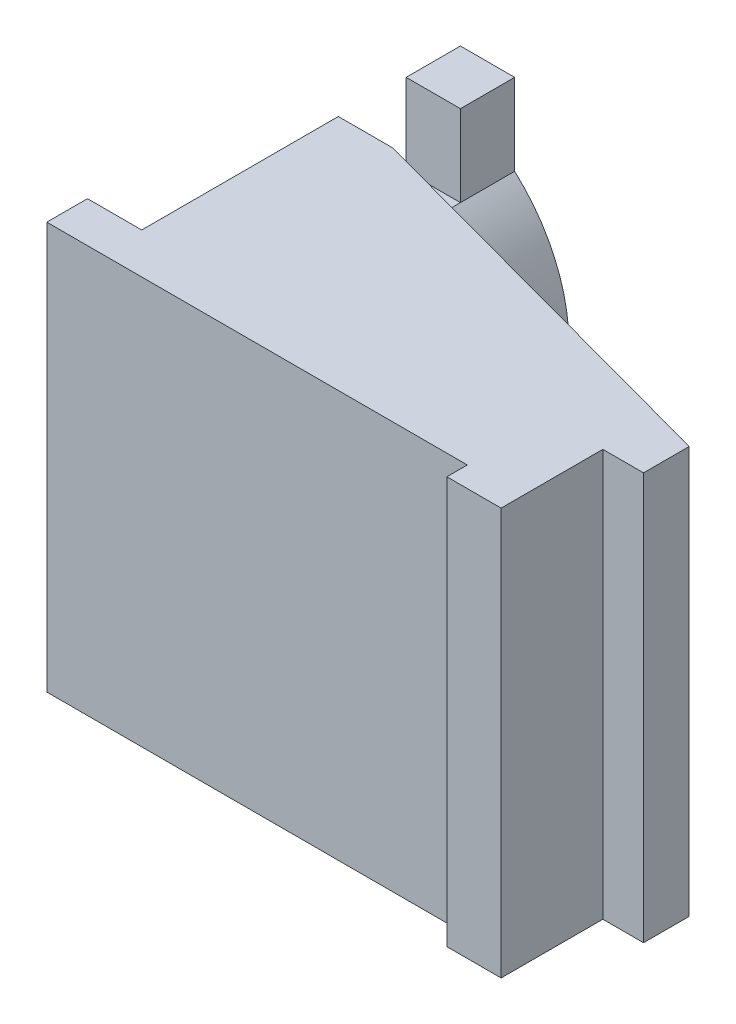
ISO-10303-21;
HEADER;
FILE_DESCRIPTION(('STEP AP214'),'2;1');
FILE_NAME('part.step','',(''),(''),'','','');
FILE_SCHEMA(('AUTOMOTIVE_DESIGN { 1 0 10303 214 1 1 1 1 }'));
ENDSEC;
DATA;
#1=APPLICATION_CONTEXT('core data for automotive mechanical design processes');
#2=APPLICATION_PROTOCOL_DEFINITION('international standard','automotive_design',2000,#1);
#3=PRODUCT_CONTEXT('',#1,'mechanical');
#4=PRODUCT('Part','Part','',(#3));
#5=PRODUCT_RELATED_PRODUCT_CATEGORY('part','',(#4));
#6=PRODUCT_DEFINITION_FORMATION('','',#4);
#7=PRODUCT_DEFINITION_CONTEXT('part definition',#1,'design');
#8=PRODUCT_DEFINITION('design','',#6,#7);
#9=PRODUCT_DEFINITION_SHAPE('','',#8);
#10=(LENGTH_UNIT() NAMED_UNIT(*) SI_UNIT(.MILLI.,.METRE.));
#11=(NAMED_UNIT(*) PLANE_ANGLE_UNIT() SI_UNIT($,.RADIAN.));
#12=(NAMED_UNIT(*) SI_UNIT($,.STERADIAN.) SOLID_ANGLE_UNIT());
#13=UNCERTAINTY_MEASURE_WITH_UNIT(LENGTH_MEASURE(1.E-05),#10,'distance_accuracy_value','');
#14=(GEOMETRIC_REPRESENTATION_CONTEXT(3) GLOBAL_UNCERTAINTY_ASSIGNED_CONTEXT((#13)) GLOBAL_UNIT_ASSIGNED_CONTEXT((#10,
#11,#12)) REPRESENTATION_CONTEXT('',''));
#15=CARTESIAN_POINT('',(0.,0.,0.));
#16=DIRECTION('',(0.,0.,1.));
#17=DIRECTION('',(1.,0.,0.));
#18=AXIS2_PLACEMENT_3D('',#15,#16,#17);
#19=CARTESIAN_POINT('',(4.00000000000001,7.5,0.));
#20=DIRECTION('',(1.,0.,0.));
#21=DIRECTION('',(0.,0.,-1.));
#22=AXIS2_PLACEMENT_3D('',#19,#20,#21);
#23=PLANE('',#22);
#24=DIRECTION('',(0.,0.,-1.));
#25=VECTOR('',#24,1.);
#26=CARTESIAN_POINT('',(4.,-4.5,0.911411798026829));
#27=LINE('',#26,#25);
#28=CARTESIAN_POINT('',(4.,-4.5,-11.2456211253562));
#29=VERTEX_POINT('',#28);
#30=CARTESIAN_POINT('',(4.,-4.5,-13.2456211253562));
#31=VERTEX_POINT('',#30);
#32=EDGE_CURVE('E207',#29,#31,#27,.T.);
#33=ORIENTED_EDGE('',*,*,#32,.F.);
#34=DIRECTION('',(0.,-1.,0.));
#35=VECTOR('',#34,1.);
#36=CARTESIAN_POINT('',(4.,7.5,-11.2456211253562));
#37=LINE('',#36,#35);
#38=CARTESIAN_POINT('',(4.,-7.5,-11.2456211253562));
#39=VERTEX_POINT('',#38);
#40=EDGE_CURVE('E368',#29,#39,#37,.T.);
#41=ORIENTED_EDGE('',*,*,#40,.T.);
#42=DIRECTION('',(0.,0.,1.));
#43=VECTOR('',#42,1.);
#44=CARTESIAN_POINT('',(4.00000000000001,-7.5,0.));
#45=LINE('',#44,#43);
#46=CARTESIAN_POINT('',(4.,-7.5,-13.2456211253562));
#47=VERTEX_POINT('',#46);
#48=EDGE_CURVE('E282',#47,#39,#45,.T.);
#49=ORIENTED_EDGE('',*,*,#48,.F.);
#50=DIRECTION('',(0.,-1.,0.));
#51=VECTOR('',#50,1.);
#52=CARTESIAN_POINT('',(4.,7.5,-13.2456211253562));
#53=LINE('',#52,#51);
#54=EDGE_CURVE('E52',#31,#47,#53,.T.);
#55=ORIENTED_EDGE('',*,*,#54,.F.);
#56=EDGE_LOOP('',(#33,#41,#49,#55));
#57=FACE_BOUND('',#56,.T.);
#58=ADVANCED_FACE('F37',(#57),#23,.T.);
#59=DIRECTION('',(0.,0.,-1.));
#60=VECTOR('',#59,1.);
#61=CARTESIAN_POINT('',(4.,4.5,0.911411798026829));
#62=LINE('',#61,#60);
#63=CARTESIAN_POINT('',(4.,4.5,-11.2456211253562));
#64=VERTEX_POINT('',#63);
#65=CARTESIAN_POINT('',(4.,4.5,-13.2456211253562));
#66=VERTEX_POINT('',#65);
#67=EDGE_CURVE('E60',#64,#66,#62,.T.);
#68=ORIENTED_EDGE('',*,*,#67,.T.);
#69=CARTESIAN_POINT('',(4.,7.5,-13.2456211253562));
#70=VERTEX_POINT('',#69);
#71=EDGE_CURVE('E197',#70,#66,#53,.T.);
#72=ORIENTED_EDGE('',*,*,#71,.F.);
#73=DIRECTION('',(0.,0.,1.));
#74=VECTOR('',#73,1.);
#75=CARTESIAN_POINT('',(4.00000000000001,7.5,0.));
#76=LINE('',#75,#74);
#77=CARTESIAN_POINT('',(4.,7.5,-11.2456211253562));
#78=VERTEX_POINT('',#77);
#79=EDGE_CURVE('E246',#70,#78,#76,.T.);
#80=ORIENTED_EDGE('',*,*,#79,.T.);
#81=DIRECTION('',(0.,-1.,0.));
#82=VECTOR('',#81,1.);
#83=CARTESIAN_POINT('',(4.,7.5,-11.2456211253562));
#84=LINE('',#83,#82);
#85=EDGE_CURVE('E216',#78,#64,#84,.T.);
#86=ORIENTED_EDGE('',*,*,#85,.T.);
#87=EDGE_LOOP('',(#68,#72,#80,#86));
#88=FACE_BOUND('',#87,.T.);
#89=ADVANCED_FACE('F376',(#88),#23,.T.);
#90=CARTESIAN_POINT('',(2.,7.5,0.));
#91=DIRECTION('',(-1.,0.,0.));
#92=DIRECTION('',(0.,0.,1.));
#93=AXIS2_PLACEMENT_3D('',#90,#91,#92);
#94=PLANE('',#93);
#95=DIRECTION('',(0.,0.,1.));
#96=VECTOR('',#95,1.);
#97=CARTESIAN_POINT('',(2.,-4.5,0.));
#98=LINE('',#97,#96);
#99=CARTESIAN_POINT('',(2.,-4.5,-11.2456211253562));
#100=VERTEX_POINT('',#99);
#101=CARTESIAN_POINT('',(2.,-4.5,-8.74562112535625));
#102=VERTEX_POINT('',#101);
#103=EDGE_CURVE('E11',#100,#102,#98,.T.);
#104=ORIENTED_EDGE('',*,*,#103,.T.);
#105=DIRECTION('',(0.,-1.,0.));
#106=VECTOR('',#105,1.);
#107=CARTESIAN_POINT('',(2.,7.5,-8.74562112535625));
#108=LINE('',#107,#106);
#109=CARTESIAN_POINT('',(2.,-7.5,-8.74562112535625));
#110=VERTEX_POINT('',#109);
#111=EDGE_CURVE('E363',#102,#110,#108,.T.);
#112=ORIENTED_EDGE('',*,*,#111,.T.);
#113=DIRECTION('',(0.,0.,-1.));
#114=VECTOR('',#113,1.);
#115=CARTESIAN_POINT('',(2.,-7.5,0.));
#116=LINE('',#115,#114);
#117=CARTESIAN_POINT('',(2.,-7.5,-1.5));
#118=VERTEX_POINT('',#117);
#119=EDGE_CURVE('E224',#118,#110,#116,.T.);
#120=ORIENTED_EDGE('',*,*,#119,.F.);
#121=DIRECTION('',(0.,-1.,0.));
#122=VECTOR('',#121,1.);
#123=CARTESIAN_POINT('',(2.,7.5,-1.5));
#124=LINE('',#123,#122);
#125=CARTESIAN_POINT('',(2.,7.5,-1.5));
#126=VERTEX_POINT('',#125);
#127=EDGE_CURVE('E256',#126,#118,#124,.T.);
#128=ORIENTED_EDGE('',*,*,#127,.F.);
#129=DIRECTION('',(0.,0.,-1.));
#130=VECTOR('',#129,1.);
#131=CARTESIAN_POINT('',(2.,7.5,0.));
#132=LINE('',#131,#130);
#133=CARTESIAN_POINT('',(2.,7.5,-8.74562112535625));
#134=VERTEX_POINT('',#133);
#135=EDGE_CURVE('E253',#126,#134,#132,.T.);
#136=ORIENTED_EDGE('',*,*,#135,.T.);
#137=DIRECTION('',(0.,-1.,0.));
#138=VECTOR('',#137,1.);
#139=CARTESIAN_POINT('',(2.,7.5,-8.74562112535625));
#140=LINE('',#139,#138);
#141=CARTESIAN_POINT('',(2.,4.5,-8.74562112535625));
#142=VERTEX_POINT('',#141);
#143=EDGE_CURVE('E212',#134,#142,#140,.T.);
#144=ORIENTED_EDGE('',*,*,#143,.T.);
#145=DIRECTION('',(0.,0.,-1.));
#146=VECTOR('',#145,1.);
#147=CARTESIAN_POINT('',(2.,4.5,0.));
#148=LINE('',#147,#146);
#149=CARTESIAN_POINT('',(2.,4.5,-11.2456211253562));
#150=VERTEX_POINT('',#149);
#151=EDGE_CURVE('E45',#142,#150,#148,.T.);
#152=ORIENTED_EDGE('',*,*,#151,.T.);
#153=DIRECTION('',(0.,1.,0.));
#154=VECTOR('',#153,1.);
#155=CARTESIAN_POINT('',(2.,7.5,-11.2456211253562));
#156=LINE('',#155,#154);
#157=CARTESIAN_POINT('',(2.,7.5,-11.2456211253562));
#158=VERTEX_POINT('',#157);
#159=EDGE_CURVE('E321',#150,#158,#156,.T.);
#160=ORIENTED_EDGE('',*,*,#159,.T.);
#161=CARTESIAN_POINT('',(2.,7.5,-13.2456211253562));
#162=VERTEX_POINT('',#161);
#163=EDGE_CURVE('E252',#158,#162,#132,.T.);
#164=ORIENTED_EDGE('',*,*,#163,.T.);
#165=DIRECTION('',(0.,-1.,0.));
#166=VECTOR('',#165,1.);
#167=CARTESIAN_POINT('',(2.,7.5,-13.2456211253562));
#168=LINE('',#167,#166);
#169=CARTESIAN_POINT('',(2.,-7.5,-13.2456211253562));
#170=VERTEX_POINT('',#169);
#171=EDGE_CURVE('E292',#162,#170,#168,.T.);
#172=ORIENTED_EDGE('',*,*,#171,.T.);
#173=CARTESIAN_POINT('',(2.,-7.5,-11.2456211253562));
#174=VERTEX_POINT('',#173);
#175=EDGE_CURVE('E288',#174,#170,#116,.T.);
#176=ORIENTED_EDGE('',*,*,#175,.F.);
#177=DIRECTION('',(0.,1.,0.));
#178=VECTOR('',#177,1.);
#179=CARTESIAN_POINT('',(2.,7.5,-11.2456211253562));
#180=LINE('',#179,#178);
#181=EDGE_CURVE('E372',#174,#100,#180,.T.);
#182=ORIENTED_EDGE('',*,*,#181,.T.);
#183=EDGE_LOOP('',(#104,#112,#120,#128,#136,#144,#152,#160,#164,#172,#176,#182));
#184=FACE_BOUND('',#183,.T.);
#185=ADVANCED_FACE('F320',(#184),#94,.T.);
#186=CARTESIAN_POINT('',(0.,7.5,0.));
#187=DIRECTION('',(0.,1.,0.));
#188=DIRECTION('',(0.,0.,1.));
#189=AXIS2_PLACEMENT_3D('',#186,#187,#188);
#190=PLANE('',#189);
#191=DIRECTION('',(-0.965162119366851,0.,-0.261652600482567));
#192=VECTOR('',#191,1.);
#193=CARTESIAN_POINT('',(2.48244281588149,7.5,-9.15702639669666));
#194=LINE('',#193,#192);
#195=CARTESIAN_POINT('',(19.,7.5,-4.67916541964209));
#196=VERTEX_POINT('',#195);
#197=CARTESIAN_POINT('',(4.00000000000001,7.5,-8.74562112535625));
#198=VERTEX_POINT('',#197);
#199=EDGE_CURVE('E244',#196,#198,#194,.T.);
#200=ORIENTED_EDGE('',*,*,#199,.T.);
#201=DIRECTION('',(-1.,0.,0.));
#202=VECTOR('',#201,1.);
#203=CARTESIAN_POINT('',(0.,7.5,-8.74562112535625));
#204=LINE('',#203,#202);
#205=EDGE_CURVE('E192',#198,#134,#204,.T.);
#206=ORIENTED_EDGE('',*,*,#205,.T.);
#207=ORIENTED_EDGE('',*,*,#135,.F.);
#208=DIRECTION('',(1.,0.,0.));
#209=VECTOR('',#208,1.);
#210=CARTESIAN_POINT('',(0.,7.5,-1.5));
#211=LINE('',#210,#209);
#212=CARTESIAN_POINT('',(0.,7.5,-1.5));
#213=VERTEX_POINT('',#212);
#214=EDGE_CURVE('E220',#213,#126,#211,.T.);
#215=ORIENTED_EDGE('',*,*,#214,.F.);
#216=DIRECTION('',(0.,0.,-1.));
#217=VECTOR('',#216,1.);
#218=CARTESIAN_POINT('',(0.,7.5,0.));
#219=LINE('',#218,#217);
#220=CARTESIAN_POINT('',(0.,7.5,0.));
#221=VERTEX_POINT('',#220);
#222=EDGE_CURVE('E223',#221,#213,#219,.T.);
#223=ORIENTED_EDGE('',*,*,#222,.F.);
#224=DIRECTION('',(-1.,0.,0.));
#225=VECTOR('',#224,1.);
#226=CARTESIAN_POINT('',(0.,7.5,0.));
#227=LINE('',#226,#225);
#228=CARTESIAN_POINT('',(15.5,7.5,0.));
#229=VERTEX_POINT('',#228);
#230=EDGE_CURVE('E227',#229,#221,#227,.T.);
#231=ORIENTED_EDGE('',*,*,#230,.F.);
#232=DIRECTION('',(0.,0.,-1.));
#233=VECTOR('',#232,1.);
#234=CARTESIAN_POINT('',(15.5,7.5,0.));
#235=LINE('',#234,#233);
#236=CARTESIAN_POINT('',(15.5,7.5,0.75437887464375));
#237=VERTEX_POINT('',#236);
#238=EDGE_CURVE('E230',#237,#229,#235,.T.);
#239=ORIENTED_EDGE('',*,*,#238,.F.);
#240=DIRECTION('',(-1.,0.,0.));
#241=VECTOR('',#240,1.);
#242=CARTESIAN_POINT('',(0.,7.5,0.754378874643752));
#243=LINE('',#242,#241);
#244=CARTESIAN_POINT('',(17.5,7.5,0.75437887464375));
#245=VERTEX_POINT('',#244);
#246=EDGE_CURVE('E233',#245,#237,#243,.T.);
#247=ORIENTED_EDGE('',*,*,#246,.F.);
#248=DIRECTION('',(0.,0.,-1.));
#249=VECTOR('',#248,1.);
#250=CARTESIAN_POINT('',(17.5,7.5,0.));
#251=LINE('',#250,#249);
#252=CARTESIAN_POINT('',(17.5,7.5,-2.99562112535626));
#253=VERTEX_POINT('',#252);
#254=EDGE_CURVE('E236',#245,#253,#251,.T.);
#255=ORIENTED_EDGE('',*,*,#254,.T.);
#256=DIRECTION('',(-1.,0.,0.));
#257=VECTOR('',#256,1.);
#258=CARTESIAN_POINT('',(0.,7.5,-2.99562112535626));
#259=LINE('',#258,#257);
#260=CARTESIAN_POINT('',(19.,7.5,-2.99562112535626));
#261=VERTEX_POINT('',#260);
#262=EDGE_CURVE('E238',#261,#253,#259,.T.);
#263=ORIENTED_EDGE('',*,*,#262,.F.);
#264=DIRECTION('',(0.,0.,1.));
#265=VECTOR('',#264,1.);
#266=CARTESIAN_POINT('',(19.,7.5,0.));
#267=LINE('',#266,#265);
#268=EDGE_CURVE('E241',#196,#261,#267,.T.);
#269=ORIENTED_EDGE('',*,*,#268,.F.);
#270=EDGE_LOOP('',(#200,#206,#207,#215,#223,#231,#239,#247,#255,#263,#269));
#271=FACE_BOUND('',#270,.T.);
#272=ADVANCED_FACE('F325',(#271),#190,.T.);
#273=ORIENTED_EDGE('',*,*,#163,.F.);
#274=DIRECTION('',(1.,0.,0.));
#275=VECTOR('',#274,1.);
#276=CARTESIAN_POINT('',(0.,7.5,-11.2456211253562));
#277=LINE('',#276,#275);
#278=EDGE_CURVE('E315',#158,#78,#277,.T.);
#279=ORIENTED_EDGE('',*,*,#278,.T.);
#280=ORIENTED_EDGE('',*,*,#79,.F.);
#281=DIRECTION('',(1.,0.,0.));
#282=VECTOR('',#281,1.);
#283=CARTESIAN_POINT('',(0.,7.5,-13.2456211253562));
#284=LINE('',#283,#282);
#285=EDGE_CURVE('E249',#162,#70,#284,.T.);
#286=ORIENTED_EDGE('',*,*,#285,.F.);
#287=EDGE_LOOP('',(#273,#279,#280,#286));
#288=FACE_BOUND('',#287,.T.);
#289=ADVANCED_FACE('F381',(#288),#190,.T.);
#290=CARTESIAN_POINT('',(0.,-7.5,0.));
#291=DIRECTION('',(0.,1.,0.));
#292=DIRECTION('',(0.,0.,1.));
#293=AXIS2_PLACEMENT_3D('',#290,#291,#292);
#294=PLANE('',#293);
#295=DIRECTION('',(-1.,0.,0.));
#296=VECTOR('',#295,1.);
#297=CARTESIAN_POINT('',(0.,-7.5,-8.74562112535625));
#298=LINE('',#297,#296);
#299=CARTESIAN_POINT('',(4.00000000000001,-7.5,-8.74562112535625));
#300=VERTEX_POINT('',#299);
#301=EDGE_CURVE('E313',#300,#110,#298,.T.);
#302=ORIENTED_EDGE('',*,*,#301,.F.);
#303=DIRECTION('',(-0.965162119366851,0.,-0.261652600482567));
#304=VECTOR('',#303,1.);
#305=CARTESIAN_POINT('',(2.48244281588149,-7.5,-9.15702639669666));
#306=LINE('',#305,#304);
#307=CARTESIAN_POINT('',(19.,-7.5,-4.67916541964209));
#308=VERTEX_POINT('',#307);
#309=EDGE_CURVE('E280',#308,#300,#306,.T.);
#310=ORIENTED_EDGE('',*,*,#309,.F.);
#311=DIRECTION('',(0.,0.,1.));
#312=VECTOR('',#311,1.);
#313=CARTESIAN_POINT('',(19.,-7.5,0.));
#314=LINE('',#313,#312);
#315=CARTESIAN_POINT('',(19.,-7.5,-2.99562112535626));
#316=VERTEX_POINT('',#315);
#317=EDGE_CURVE('E277',#308,#316,#314,.T.);
#318=ORIENTED_EDGE('',*,*,#317,.T.);
#319=DIRECTION('',(-1.,0.,0.));
#320=VECTOR('',#319,1.);
#321=CARTESIAN_POINT('',(0.,-7.5,-2.99562112535626));
#322=LINE('',#321,#320);
#323=CARTESIAN_POINT('',(17.5,-7.5,-2.99562112535626));
#324=VERTEX_POINT('',#323);
#325=EDGE_CURVE('E274',#316,#324,#322,.T.);
#326=ORIENTED_EDGE('',*,*,#325,.T.);
#327=DIRECTION('',(0.,0.,-1.));
#328=VECTOR('',#327,1.);
#329=CARTESIAN_POINT('',(17.5,-7.5,0.));
#330=LINE('',#329,#328);
#331=CARTESIAN_POINT('',(17.5,-7.5,0.75437887464375));
#332=VERTEX_POINT('',#331);
#333=EDGE_CURVE('E271',#332,#324,#330,.T.);
#334=ORIENTED_EDGE('',*,*,#333,.F.);
#335=DIRECTION('',(-1.,0.,0.));
#336=VECTOR('',#335,1.);
#337=CARTESIAN_POINT('',(0.,-7.5,0.754378874643752));
#338=LINE('',#337,#336);
#339=CARTESIAN_POINT('',(15.5,-7.5,0.75437887464375));
#340=VERTEX_POINT('',#339);
#341=EDGE_CURVE('E268',#332,#340,#338,.T.);
#342=ORIENTED_EDGE('',*,*,#341,.T.);
#343=DIRECTION('',(0.,0.,-1.));
#344=VECTOR('',#343,1.);
#345=CARTESIAN_POINT('',(15.5,-7.5,0.));
#346=LINE('',#345,#344);
#347=CARTESIAN_POINT('',(15.5,-7.5,0.));
#348=VERTEX_POINT('',#347);
#349=EDGE_CURVE('E265',#340,#348,#346,.T.);
#350=ORIENTED_EDGE('',*,*,#349,.T.);
#351=DIRECTION('',(-1.,0.,0.));
#352=VECTOR('',#351,1.);
#353=CARTESIAN_POINT('',(0.,-7.5,0.));
#354=LINE('',#353,#352);
#355=CARTESIAN_POINT('',(0.,-7.5,0.));
#356=VERTEX_POINT('',#355);
#357=EDGE_CURVE('E262',#348,#356,#354,.T.);
#358=ORIENTED_EDGE('',*,*,#357,.T.);
#359=DIRECTION('',(0.,0.,-1.));
#360=VECTOR('',#359,1.);
#361=CARTESIAN_POINT('',(0.,-7.5,0.));
#362=LINE('',#361,#360);
#363=CARTESIAN_POINT('',(0.,-7.5,-1.5));
#364=VERTEX_POINT('',#363);
#365=EDGE_CURVE('E259',#356,#364,#362,.T.);
#366=ORIENTED_EDGE('',*,*,#365,.T.);
#367=DIRECTION('',(1.,0.,0.));
#368=VECTOR('',#367,1.);
#369=CARTESIAN_POINT('',(0.,-7.5,-1.5));
#370=LINE('',#369,#368);
#371=EDGE_CURVE('E214',#364,#118,#370,.T.);
#372=ORIENTED_EDGE('',*,*,#371,.T.);
#373=ORIENTED_EDGE('',*,*,#119,.T.);
#374=EDGE_LOOP('',(#302,#310,#318,#326,#334,#342,#350,#358,#366,#372,#373));
#375=FACE_BOUND('',#374,.T.);
#376=ADVANCED_FACE('F334',(#375),#294,.F.);
#377=DIRECTION('',(1.,0.,0.));
#378=VECTOR('',#377,1.);
#379=CARTESIAN_POINT('',(0.,-7.5,-11.2456211253562));
#380=LINE('',#379,#378);
#381=EDGE_CURVE('E311',#174,#39,#380,.T.);
#382=ORIENTED_EDGE('',*,*,#381,.F.);
#383=ORIENTED_EDGE('',*,*,#175,.T.);
#384=DIRECTION('',(1.,0.,0.));
#385=VECTOR('',#384,1.);
#386=CARTESIAN_POINT('',(0.,-7.5,-13.2456211253562));
#387=LINE('',#386,#385);
#388=EDGE_CURVE('E285',#170,#47,#387,.T.);
#389=ORIENTED_EDGE('',*,*,#388,.T.);
#390=ORIENTED_EDGE('',*,*,#48,.T.);
#391=EDGE_LOOP('',(#382,#383,#389,#390));
#392=FACE_BOUND('',#391,.T.);
#393=ADVANCED_FACE('F391',(#392),#294,.F.);
#394=CARTESIAN_POINT('',(0.,7.5,-1.5));
#395=DIRECTION('',(0.,0.,-1.));
#396=DIRECTION('',(-1.,0.,0.));
#397=AXIS2_PLACEMENT_3D('',#394,#395,#396);
#398=PLANE('',#397);
#399=ORIENTED_EDGE('',*,*,#371,.F.);
#400=DIRECTION('',(0.,-1.,0.));
#401=VECTOR('',#400,1.);
#402=CARTESIAN_POINT('',(0.,7.5,-1.5));
#403=LINE('',#402,#401);
#404=EDGE_CURVE('E309',#213,#364,#403,.T.);
#405=ORIENTED_EDGE('',*,*,#404,.F.);
#406=ORIENTED_EDGE('',*,*,#214,.T.);
#407=ORIENTED_EDGE('',*,*,#127,.T.);
#408=EDGE_LOOP('',(#399,#405,#406,#407));
#409=FACE_BOUND('',#408,.T.);
#410=ADVANCED_FACE('F39',(#409),#398,.T.);
#411=CARTESIAN_POINT('',(0.,7.5,0.));
#412=DIRECTION('',(-1.,0.,0.));
#413=DIRECTION('',(0.,0.,1.));
#414=AXIS2_PLACEMENT_3D('',#411,#412,#413);
#415=PLANE('',#414);
#416=ORIENTED_EDGE('',*,*,#365,.F.);
#417=DIRECTION('',(0.,-1.,0.));
#418=VECTOR('',#417,1.);
#419=CARTESIAN_POINT('',(0.,7.5,0.));
#420=LINE('',#419,#418);
#421=EDGE_CURVE('E307',#221,#356,#420,.T.);
#422=ORIENTED_EDGE('',*,*,#421,.F.);
#423=ORIENTED_EDGE('',*,*,#222,.T.);
#424=ORIENTED_EDGE('',*,*,#404,.T.);
#425=EDGE_LOOP('',(#416,#422,#423,#424));
#426=FACE_BOUND('',#425,.T.);
#427=ADVANCED_FACE('F358',(#426),#415,.T.);
#428=CARTESIAN_POINT('',(0.,7.5,0.));
#429=DIRECTION('',(0.,0.,1.));
#430=DIRECTION('',(1.,0.,0.));
#431=AXIS2_PLACEMENT_3D('',#428,#429,#430);
#432=PLANE('',#431);
#433=ORIENTED_EDGE('',*,*,#357,.F.);
#434=DIRECTION('',(0.,-1.,0.));
#435=VECTOR('',#434,1.);
#436=CARTESIAN_POINT('',(15.5,7.5,0.));
#437=LINE('',#436,#435);
#438=EDGE_CURVE('E305',#229,#348,#437,.T.);
#439=ORIENTED_EDGE('',*,*,#438,.F.);
#440=ORIENTED_EDGE('',*,*,#230,.T.);
#441=ORIENTED_EDGE('',*,*,#421,.T.);
#442=EDGE_LOOP('',(#433,#439,#440,#441));
#443=FACE_BOUND('',#442,.T.);
#444=ADVANCED_FACE('F354',(#443),#432,.T.);
#445=CARTESIAN_POINT('',(15.5,7.5,0.));
#446=DIRECTION('',(-1.,0.,0.));
#447=DIRECTION('',(0.,0.,1.));
#448=AXIS2_PLACEMENT_3D('',#445,#446,#447);
#449=PLANE('',#448);
#450=ORIENTED_EDGE('',*,*,#349,.F.);
#451=DIRECTION('',(0.,-1.,0.));
#452=VECTOR('',#451,1.);
#453=CARTESIAN_POINT('',(15.5,7.5,0.75437887464375));
#454=LINE('',#453,#452);
#455=EDGE_CURVE('E303',#237,#340,#454,.T.);
#456=ORIENTED_EDGE('',*,*,#455,.F.);
#457=ORIENTED_EDGE('',*,*,#238,.T.);
#458=ORIENTED_EDGE('',*,*,#438,.T.);
#459=EDGE_LOOP('',(#450,#456,#457,#458));
#460=FACE_BOUND('',#459,.T.);
#461=ADVANCED_FACE('F350',(#460),#449,.T.);
#462=CARTESIAN_POINT('',(0.,7.5,0.754378874643752));
#463=DIRECTION('',(0.,0.,1.));
#464=DIRECTION('',(1.,0.,0.));
#465=AXIS2_PLACEMENT_3D('',#462,#463,#464);
#466=PLANE('',#465);
#467=ORIENTED_EDGE('',*,*,#341,.F.);
#468=DIRECTION('',(0.,-1.,0.));
#469=VECTOR('',#468,1.);
#470=CARTESIAN_POINT('',(17.5,7.5,0.75437887464375));
#471=LINE('',#470,#469);
#472=EDGE_CURVE('E301',#245,#332,#471,.T.);
#473=ORIENTED_EDGE('',*,*,#472,.F.);
#474=ORIENTED_EDGE('',*,*,#246,.T.);
#475=ORIENTED_EDGE('',*,*,#455,.T.);
#476=EDGE_LOOP('',(#467,#473,#474,#475));
#477=FACE_BOUND('',#476,.T.);
#478=ADVANCED_FACE('F344',(#477),#466,.T.);
#479=CARTESIAN_POINT('',(17.5,7.5,0.));
#480=DIRECTION('',(-1.,0.,0.));
#481=DIRECTION('',(0.,0.,1.));
#482=AXIS2_PLACEMENT_3D('',#479,#480,#481);
#483=PLANE('',#482);
#484=ORIENTED_EDGE('',*,*,#333,.T.);
#485=DIRECTION('',(0.,-1.,0.));
#486=VECTOR('',#485,1.);
#487=CARTESIAN_POINT('',(17.5,7.5,-2.99562112535626));
#488=LINE('',#487,#486);
#489=EDGE_CURVE('E299',#253,#324,#488,.T.);
#490=ORIENTED_EDGE('',*,*,#489,.F.);
#491=ORIENTED_EDGE('',*,*,#254,.F.);
#492=ORIENTED_EDGE('',*,*,#472,.T.);
#493=EDGE_LOOP('',(#484,#490,#491,#492));
#494=FACE_BOUND('',#493,.T.);
#495=ADVANCED_FACE('F430',(#494),#483,.F.);
#496=CARTESIAN_POINT('',(0.,7.5,-2.99562112535626));
#497=DIRECTION('',(0.,0.,1.));
#498=DIRECTION('',(1.,0.,0.));
#499=AXIS2_PLACEMENT_3D('',#496,#497,#498);
#500=PLANE('',#499);
#501=ORIENTED_EDGE('',*,*,#325,.F.);
#502=DIRECTION('',(0.,-1.,0.));
#503=VECTOR('',#502,1.);
#504=CARTESIAN_POINT('',(19.,7.5,-2.99562112535626));
#505=LINE('',#504,#503);
#506=EDGE_CURVE('E297',#261,#316,#505,.T.);
#507=ORIENTED_EDGE('',*,*,#506,.F.);
#508=ORIENTED_EDGE('',*,*,#262,.T.);
#509=ORIENTED_EDGE('',*,*,#489,.T.);
#510=EDGE_LOOP('',(#501,#507,#508,#509));
#511=FACE_BOUND('',#510,.T.);
#512=ADVANCED_FACE('F338',(#511),#500,.T.);
#513=CARTESIAN_POINT('',(19.,7.5,0.));
#514=DIRECTION('',(1.,0.,0.));
#515=DIRECTION('',(0.,0.,-1.));
#516=AXIS2_PLACEMENT_3D('',#513,#514,#515);
#517=PLANE('',#516);
#518=ORIENTED_EDGE('',*,*,#317,.F.);
#519=DIRECTION('',(0.,-1.,0.));
#520=VECTOR('',#519,1.);
#521=CARTESIAN_POINT('',(19.,7.5,-4.67916541964209));
#522=LINE('',#521,#520);
#523=EDGE_CURVE('E196',#196,#308,#522,.T.);
#524=ORIENTED_EDGE('',*,*,#523,.F.);
#525=ORIENTED_EDGE('',*,*,#268,.T.);
#526=ORIENTED_EDGE('',*,*,#506,.T.);
#527=EDGE_LOOP('',(#518,#524,#525,#526));
#528=FACE_BOUND('',#527,.T.);
#529=ADVANCED_FACE('F335',(#528),#517,.T.);
#530=CARTESIAN_POINT('',(2.48244281588149,7.5,-9.15702639669666));
#531=DIRECTION('',(-0.261652600482567,0.,0.96516211936685));
#532=DIRECTION('',(0.965162119366851,0.,0.261652600482567));
#533=AXIS2_PLACEMENT_3D('',#530,#531,#532);
#534=PLANE('',#533);
#535=DIRECTION('',(0.,1.,0.));
#536=VECTOR('',#535,1.);
#537=CARTESIAN_POINT('',(4.,7.5,-8.74562112535625));
#538=LINE('',#537,#536);
#539=CARTESIAN_POINT('',(4.,-4.5,-8.74562112535625));
#540=VERTEX_POINT('',#539);
#541=EDGE_CURVE('E204',#300,#540,#538,.T.);
#542=ORIENTED_EDGE('',*,*,#541,.T.);
#543=CARTESIAN_POINT('',(-0.0625000000000009,0.,-9.84695287898717));
#544=DIRECTION('',(-0.261652600482567,0.,0.96516211936685));
#545=DIRECTION('',(-0.965162119366851,0.,-0.261652600482567));
#546=AXIS2_PLACEMENT_3D('',#543,#544,#545);
#547=ELLIPSE('',#546,6.28132816067939,6.0625);
#548=CARTESIAN_POINT('',(4.,4.5,-8.74562112535625));
#549=VERTEX_POINT('',#548);
#550=EDGE_CURVE('E201',#549,#540,#547,.F.);
#551=ORIENTED_EDGE('',*,*,#550,.F.);
#552=DIRECTION('',(0.,-1.,0.));
#553=VECTOR('',#552,1.);
#554=CARTESIAN_POINT('',(4.,7.5,-8.74562112535625));
#555=LINE('',#554,#553);
#556=EDGE_CURVE('E188',#198,#549,#555,.T.);
#557=ORIENTED_EDGE('',*,*,#556,.F.);
#558=ORIENTED_EDGE('',*,*,#199,.F.);
#559=ORIENTED_EDGE('',*,*,#523,.T.);
#560=ORIENTED_EDGE('',*,*,#309,.T.);
#561=EDGE_LOOP('',(#542,#551,#557,#558,#559,#560));
#562=FACE_BOUND('',#561,.T.);
#563=ADVANCED_FACE('F202',(#562),#534,.F.);
#564=CARTESIAN_POINT('',(0.,7.5,-13.2456211253562));
#565=DIRECTION('',(0.,0.,-1.));
#566=DIRECTION('',(-1.,0.,0.));
#567=AXIS2_PLACEMENT_3D('',#564,#565,#566);
#568=PLANE('',#567);
#569=ORIENTED_EDGE('',*,*,#388,.F.);
#570=ORIENTED_EDGE('',*,*,#171,.F.);
#571=ORIENTED_EDGE('',*,*,#285,.T.);
#572=ORIENTED_EDGE('',*,*,#71,.T.);
#573=CARTESIAN_POINT('',(-0.0625000000000009,0.,-13.2456211253562));
#574=DIRECTION('',(0.,0.,-1.));
#575=DIRECTION('',(-1.,0.,0.));
#576=AXIS2_PLACEMENT_3D('',#573,#574,#575);
#577=CIRCLE('',#576,6.0625);
#578=EDGE_CURVE('E397',#66,#31,#577,.T.);
#579=ORIENTED_EDGE('',*,*,#578,.T.);
#580=ORIENTED_EDGE('',*,*,#54,.T.);
#581=EDGE_LOOP('',(#569,#570,#571,#572,#579,#580));
#582=FACE_BOUND('',#581,.T.);
#583=ADVANCED_FACE('F387',(#582),#568,.T.);
#584=CARTESIAN_POINT('',(19.,-7.5,-8.74562112535625));
#585=DIRECTION('',(0.,0.,-1.));
#586=DIRECTION('',(-1.,0.,0.));
#587=AXIS2_PLACEMENT_3D('',#584,#585,#586);
#588=PLANE('',#587);
#589=ORIENTED_EDGE('',*,*,#301,.T.);
#590=ORIENTED_EDGE('',*,*,#111,.F.);
#591=DIRECTION('',(-1.,0.,0.));
#592=VECTOR('',#591,1.);
#593=CARTESIAN_POINT('',(19.,-4.5,-8.74562112535625));
#594=LINE('',#593,#592);
#595=EDGE_CURVE('E184',#540,#102,#594,.T.);
#596=ORIENTED_EDGE('',*,*,#595,.F.);
#597=ORIENTED_EDGE('',*,*,#541,.F.);
#598=EDGE_LOOP('',(#589,#590,#596,#597));
#599=FACE_BOUND('',#598,.T.);
#600=ADVANCED_FACE('F407',(#599),#588,.T.);
#601=CARTESIAN_POINT('',(19.,-7.5,-11.2456211253562));
#602=DIRECTION('',(0.,0.,1.));
#603=DIRECTION('',(1.,0.,0.));
#604=AXIS2_PLACEMENT_3D('',#601,#602,#603);
#605=PLANE('',#604);
#606=DIRECTION('',(-1.,0.,0.));
#607=VECTOR('',#606,1.);
#608=CARTESIAN_POINT('',(19.,-4.5,-11.2456211253562));
#609=LINE('',#608,#607);
#610=EDGE_CURVE('E394',#29,#100,#609,.T.);
#611=ORIENTED_EDGE('',*,*,#610,.T.);
#612=ORIENTED_EDGE('',*,*,#181,.F.);
#613=ORIENTED_EDGE('',*,*,#381,.T.);
#614=ORIENTED_EDGE('',*,*,#40,.F.);
#615=EDGE_LOOP('',(#611,#612,#613,#614));
#616=FACE_BOUND('',#615,.T.);
#617=ADVANCED_FACE('F404',(#616),#605,.T.);
#618=CARTESIAN_POINT('',(19.,-4.5,-8.74562112535625));
#619=DIRECTION('',(0.,-1.,0.));
#620=DIRECTION('',(0.,0.,-1.));
#621=AXIS2_PLACEMENT_3D('',#618,#619,#620);
#622=PLANE('',#621);
#623=ORIENTED_EDGE('',*,*,#595,.T.);
#624=ORIENTED_EDGE('',*,*,#103,.F.);
#625=ORIENTED_EDGE('',*,*,#610,.F.);
#626=DIRECTION('',(0.,0.,-1.));
#627=VECTOR('',#626,1.);
#628=CARTESIAN_POINT('',(4.00000000000001,-4.5,0.));
#629=LINE('',#628,#627);
#630=EDGE_CURVE('E211',#540,#29,#629,.T.);
#631=ORIENTED_EDGE('',*,*,#630,.F.);
#632=EDGE_LOOP('',(#623,#624,#625,#631));
#633=FACE_BOUND('',#632,.T.);
#634=ADVANCED_FACE('F406',(#633),#622,.T.);
#635=CARTESIAN_POINT('',(19.,7.5,-8.74562112535625));
#636=DIRECTION('',(0.,0.,-1.));
#637=DIRECTION('',(-1.,0.,0.));
#638=AXIS2_PLACEMENT_3D('',#635,#636,#637);
#639=PLANE('',#638);
#640=DIRECTION('',(-1.,0.,0.));
#641=VECTOR('',#640,1.);
#642=CARTESIAN_POINT('',(19.,4.5,-8.74562112535625));
#643=LINE('',#642,#641);
#644=EDGE_CURVE('E174',#549,#142,#643,.T.);
#645=ORIENTED_EDGE('',*,*,#644,.T.);
#646=ORIENTED_EDGE('',*,*,#143,.F.);
#647=ORIENTED_EDGE('',*,*,#205,.F.);
#648=ORIENTED_EDGE('',*,*,#556,.T.);
#649=EDGE_LOOP('',(#645,#646,#647,#648));
#650=FACE_BOUND('',#649,.T.);
#651=ADVANCED_FACE('F190',(#650),#639,.T.);
#652=CARTESIAN_POINT('',(19.,4.5,-8.74562112535625));
#653=DIRECTION('',(0.,1.,0.));
#654=DIRECTION('',(0.,0.,1.));
#655=AXIS2_PLACEMENT_3D('',#652,#653,#654);
#656=PLANE('',#655);
#657=DIRECTION('',(-1.,0.,0.));
#658=VECTOR('',#657,1.);
#659=CARTESIAN_POINT('',(19.,4.5,-11.2456211253562));
#660=LINE('',#659,#658);
#661=EDGE_CURVE('E185',#64,#150,#660,.T.);
#662=ORIENTED_EDGE('',*,*,#661,.T.);
#663=ORIENTED_EDGE('',*,*,#151,.F.);
#664=ORIENTED_EDGE('',*,*,#644,.F.);
#665=DIRECTION('',(0.,0.,1.));
#666=VECTOR('',#665,1.);
#667=CARTESIAN_POINT('',(4.00000000000001,4.5,0.));
#668=LINE('',#667,#666);
#669=EDGE_CURVE('E179',#64,#549,#668,.T.);
#670=ORIENTED_EDGE('',*,*,#669,.F.);
#671=EDGE_LOOP('',(#662,#663,#664,#670));
#672=FACE_BOUND('',#671,.T.);
#673=ADVANCED_FACE('F177',(#672),#656,.T.);
#674=CARTESIAN_POINT('',(19.,7.5,-11.2456211253562));
#675=DIRECTION('',(0.,0.,1.));
#676=DIRECTION('',(1.,0.,0.));
#677=AXIS2_PLACEMENT_3D('',#674,#675,#676);
#678=PLANE('',#677);
#679=ORIENTED_EDGE('',*,*,#278,.F.);
#680=ORIENTED_EDGE('',*,*,#159,.F.);
#681=ORIENTED_EDGE('',*,*,#661,.F.);
#682=ORIENTED_EDGE('',*,*,#85,.F.);
#683=EDGE_LOOP('',(#679,#680,#681,#682));
#684=FACE_BOUND('',#683,.T.);
#685=ADVANCED_FACE('F379',(#684),#678,.T.);
#686=CARTESIAN_POINT('',(-0.0625000000000009,0.,0.911411798026829));
#687=DIRECTION('',(0.,0.,-1.));
#688=DIRECTION('',(-1.,0.,0.));
#689=AXIS2_PLACEMENT_3D('',#686,#687,#688);
#690=CYLINDRICAL_SURFACE('',#689,6.0625);
#691=ORIENTED_EDGE('',*,*,#669,.T.);
#692=ORIENTED_EDGE('',*,*,#550,.T.);
#693=ORIENTED_EDGE('',*,*,#630,.T.);
#694=ORIENTED_EDGE('',*,*,#32,.T.);
#695=ORIENTED_EDGE('',*,*,#578,.F.);
#696=ORIENTED_EDGE('',*,*,#67,.F.);
#697=EDGE_LOOP('',(#691,#692,#693,#694,#695,#696));
#698=FACE_BOUND('',#697,.T.);
#699=ADVANCED_FACE('F209',(#698),#690,.T.);
#700=CLOSED_SHELL('',(#58,#89,#185,#272,#289,#376,#393,#410,#427,#444,#461,#478,#495,#512,#529,
#563,#583,#600,#617,#634,#651,#673,#685,#699));
#701=MANIFOLD_SOLID_BREP('B2',#700);
#702=ADVANCED_BREP_SHAPE_REPRESENTATION('',(#18,#701),#14);
#703=SHAPE_DEFINITION_REPRESENTATION(#9,#702);
ENDSEC;
END-ISO-10303-21;
